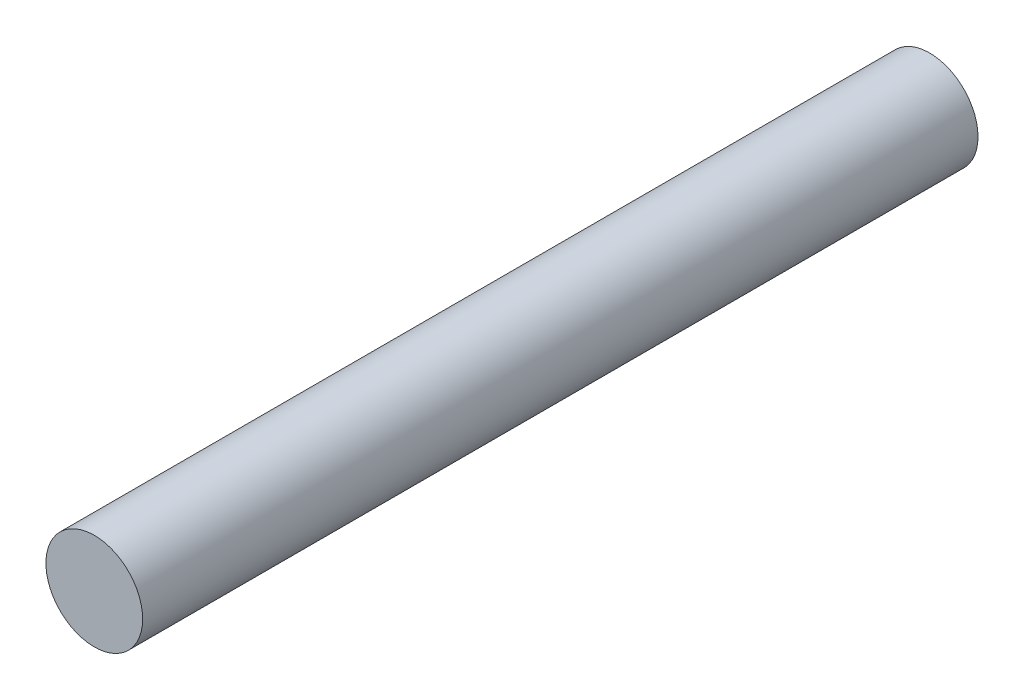
ISO-10303-21;
HEADER;
FILE_DESCRIPTION(('STEP AP214'),'2;1');
FILE_NAME('part.step','',(''),(''),'','','');
FILE_SCHEMA(('AUTOMOTIVE_DESIGN { 1 0 10303 214 1 1 1 1 }'));
ENDSEC;
DATA;
#1=APPLICATION_CONTEXT('core data for automotive mechanical design processes');
#2=APPLICATION_PROTOCOL_DEFINITION('international standard','automotive_design',2000,#1);
#3=PRODUCT_CONTEXT('',#1,'mechanical');
#4=PRODUCT('Part','Part','',(#3));
#5=PRODUCT_RELATED_PRODUCT_CATEGORY('part','',(#4));
#6=PRODUCT_DEFINITION_FORMATION('','',#4);
#7=PRODUCT_DEFINITION_CONTEXT('part definition',#1,'design');
#8=PRODUCT_DEFINITION('design','',#6,#7);
#9=PRODUCT_DEFINITION_SHAPE('','',#8);
#10=(LENGTH_UNIT() NAMED_UNIT(*) SI_UNIT(.MILLI.,.METRE.));
#11=(NAMED_UNIT(*) PLANE_ANGLE_UNIT() SI_UNIT($,.RADIAN.));
#12=(NAMED_UNIT(*) SI_UNIT($,.STERADIAN.) SOLID_ANGLE_UNIT());
#13=UNCERTAINTY_MEASURE_WITH_UNIT(LENGTH_MEASURE(1.E-05),#10,'distance_accuracy_value','');
#14=(GEOMETRIC_REPRESENTATION_CONTEXT(3) GLOBAL_UNCERTAINTY_ASSIGNED_CONTEXT((#13)) GLOBAL_UNIT_ASSIGNED_CONTEXT((#10,
#11,#12)) REPRESENTATION_CONTEXT('',''));
#15=CARTESIAN_POINT('',(0.,0.,0.));
#16=DIRECTION('',(0.,0.,1.));
#17=DIRECTION('',(1.,0.,0.));
#18=AXIS2_PLACEMENT_3D('',#15,#16,#17);
#19=CARTESIAN_POINT('',(0.,0.,50.3311258278146));
#20=DIRECTION('',(0.,0.,-1.));
#21=DIRECTION('',(-1.,0.,0.));
#22=AXIS2_PLACEMENT_3D('',#19,#20,#21);
#23=CYLINDRICAL_SURFACE('',#22,2.91390728476821);
#24=CARTESIAN_POINT('',(0.,0.,50.3311258278146));
#25=DIRECTION('',(0.,0.,1.));
#26=DIRECTION('',(1.,0.,0.));
#27=AXIS2_PLACEMENT_3D('',#24,#25,#26);
#28=CIRCLE('',#27,2.91390728476821);
#29=CARTESIAN_POINT('',(2.91390728476821,0.,50.3311258278146));
#30=VERTEX_POINT('',#29);
#31=EDGE_CURVE('E10',#30,#30,#28,.T.);
#32=ORIENTED_EDGE('',*,*,#31,.F.);
#33=EDGE_LOOP('',(#32));
#34=FACE_BOUND('',#33,.T.);
#35=CARTESIAN_POINT('',(0.,0.,0.));
#36=DIRECTION('',(0.,0.,1.));
#37=DIRECTION('',(1.,0.,0.));
#38=AXIS2_PLACEMENT_3D('',#35,#36,#37);
#39=CIRCLE('',#38,2.91390728476821);
#40=CARTESIAN_POINT('',(2.91390728476821,0.,0.));
#41=VERTEX_POINT('',#40);
#42=EDGE_CURVE('E37',#41,#41,#39,.T.);
#43=ORIENTED_EDGE('',*,*,#42,.T.);
#44=EDGE_LOOP('',(#43));
#45=FACE_BOUND('',#44,.T.);
#46=ADVANCED_FACE('F34',(#34,#45),#23,.T.);
#47=CARTESIAN_POINT('',(0.,0.,50.3311258278146));
#48=DIRECTION('',(0.,0.,1.));
#49=DIRECTION('',(1.,0.,0.));
#50=AXIS2_PLACEMENT_3D('',#47,#48,#49);
#51=PLANE('',#50);
#52=ORIENTED_EDGE('',*,*,#31,.T.);
#53=EDGE_LOOP('',(#52));
#54=FACE_BOUND('',#53,.T.);
#55=ADVANCED_FACE('F49',(#54),#51,.T.);
#56=CARTESIAN_POINT('',(0.,0.,0.));
#57=DIRECTION('',(0.,0.,1.));
#58=DIRECTION('',(1.,0.,0.));
#59=AXIS2_PLACEMENT_3D('',#56,#57,#58);
#60=PLANE('',#59);
#61=ORIENTED_EDGE('',*,*,#42,.F.);
#62=EDGE_LOOP('',(#61));
#63=FACE_BOUND('',#62,.T.);
#64=ADVANCED_FACE('F47',(#63),#60,.F.);
#65=CLOSED_SHELL('',(#46,#55,#64));
#66=MANIFOLD_SOLID_BREP('B2',#65);
#67=ADVANCED_BREP_SHAPE_REPRESENTATION('',(#18,#66),#14);
#68=SHAPE_DEFINITION_REPRESENTATION(#9,#67);
ENDSEC;
END-ISO-10303-21;
